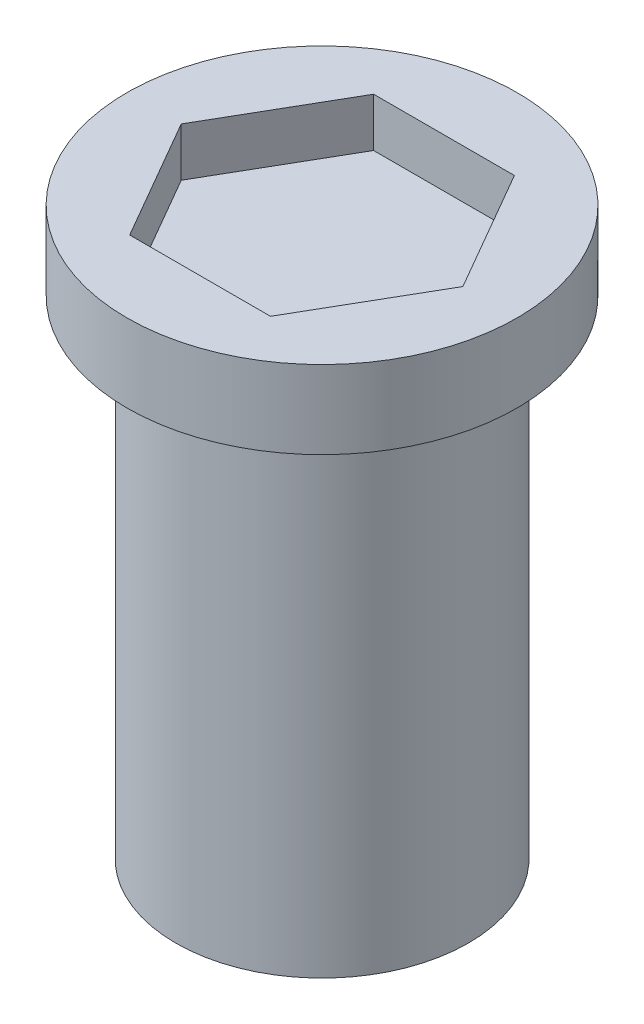
ISO-10303-21;
HEADER;
FILE_DESCRIPTION(('STEP AP214'),'2;1');
FILE_NAME('part.step','',(''),(''),'','','');
FILE_SCHEMA(('AUTOMOTIVE_DESIGN { 1 0 10303 214 1 1 1 1 }'));
ENDSEC;
DATA;
#1=APPLICATION_CONTEXT('core data for automotive mechanical design processes');
#2=APPLICATION_PROTOCOL_DEFINITION('international standard','automotive_design',2000,#1);
#3=PRODUCT_CONTEXT('',#1,'mechanical');
#4=PRODUCT('Part','Part','',(#3));
#5=PRODUCT_RELATED_PRODUCT_CATEGORY('part','',(#4));
#6=PRODUCT_DEFINITION_FORMATION('','',#4);
#7=PRODUCT_DEFINITION_CONTEXT('part definition',#1,'design');
#8=PRODUCT_DEFINITION('design','',#6,#7);
#9=PRODUCT_DEFINITION_SHAPE('','',#8);
#10=(LENGTH_UNIT() NAMED_UNIT(*) SI_UNIT(.MILLI.,.METRE.));
#11=(NAMED_UNIT(*) PLANE_ANGLE_UNIT() SI_UNIT($,.RADIAN.));
#12=(NAMED_UNIT(*) SI_UNIT($,.STERADIAN.) SOLID_ANGLE_UNIT());
#13=UNCERTAINTY_MEASURE_WITH_UNIT(LENGTH_MEASURE(1.E-05),#10,'distance_accuracy_value','');
#14=(GEOMETRIC_REPRESENTATION_CONTEXT(3) GLOBAL_UNCERTAINTY_ASSIGNED_CONTEXT((#13)) GLOBAL_UNIT_ASSIGNED_CONTEXT((#10,
#11,#12)) REPRESENTATION_CONTEXT('',''));
#15=CARTESIAN_POINT('',(0.,0.,0.));
#16=DIRECTION('',(0.,0.,1.));
#17=DIRECTION('',(1.,0.,0.));
#18=AXIS2_PLACEMENT_3D('',#15,#16,#17);
#19=CARTESIAN_POINT('',(0.,50.,0.));
#20=DIRECTION('',(0.,-1.,0.));
#21=DIRECTION('',(0.,0.,-1.));
#22=AXIS2_PLACEMENT_3D('',#19,#20,#21);
#23=CYLINDRICAL_SURFACE('',#22,15.);
#24=CARTESIAN_POINT('',(0.,50.,0.));
#25=DIRECTION('',(0.,1.,0.));
#26=DIRECTION('',(0.,0.,1.));
#27=AXIS2_PLACEMENT_3D('',#24,#25,#26);
#28=CIRCLE('',#27,15.);
#29=CARTESIAN_POINT('',(0.,50.,15.));
#30=VERTEX_POINT('',#29);
#31=EDGE_CURVE('E11',#30,#30,#28,.T.);
#32=ORIENTED_EDGE('',*,*,#31,.F.);
#33=EDGE_LOOP('',(#32));
#34=FACE_BOUND('',#33,.T.);
#35=CARTESIAN_POINT('',(0.,0.,0.));
#36=DIRECTION('',(0.,1.,0.));
#37=DIRECTION('',(0.,0.,1.));
#38=AXIS2_PLACEMENT_3D('',#35,#36,#37);
#39=CIRCLE('',#38,15.);
#40=CARTESIAN_POINT('',(0.,0.,15.));
#41=VERTEX_POINT('',#40);
#42=EDGE_CURVE('E46',#41,#41,#39,.T.);
#43=ORIENTED_EDGE('',*,*,#42,.T.);
#44=EDGE_LOOP('',(#43));
#45=FACE_BOUND('',#44,.T.);
#46=ADVANCED_FACE('F43',(#34,#45),#23,.T.);
#47=CARTESIAN_POINT('',(0.,0.,0.));
#48=DIRECTION('',(0.,1.,0.));
#49=DIRECTION('',(0.,0.,1.));
#50=AXIS2_PLACEMENT_3D('',#47,#48,#49);
#51=PLANE('',#50);
#52=ORIENTED_EDGE('',*,*,#42,.F.);
#53=EDGE_LOOP('',(#52));
#54=FACE_BOUND('',#53,.T.);
#55=ADVANCED_FACE('F193',(#54),#51,.F.);
#56=CARTESIAN_POINT('',(0.,58.,0.));
#57=DIRECTION('',(0.,-1.,0.));
#58=DIRECTION('',(0.,0.,-1.));
#59=AXIS2_PLACEMENT_3D('',#56,#57,#58);
#60=CYLINDRICAL_SURFACE('',#59,20.);
#61=CARTESIAN_POINT('',(0.,58.,0.));
#62=DIRECTION('',(0.,1.,0.));
#63=DIRECTION('',(0.,0.,1.));
#64=AXIS2_PLACEMENT_3D('',#61,#62,#63);
#65=CIRCLE('',#64,20.);
#66=CARTESIAN_POINT('',(0.,58.,20.));
#67=VERTEX_POINT('',#66);
#68=EDGE_CURVE('E167',#67,#67,#65,.T.);
#69=ORIENTED_EDGE('',*,*,#68,.F.);
#70=EDGE_LOOP('',(#69));
#71=FACE_BOUND('',#70,.T.);
#72=CARTESIAN_POINT('',(0.,50.,0.));
#73=DIRECTION('',(0.,1.,0.));
#74=DIRECTION('',(0.,0.,1.));
#75=AXIS2_PLACEMENT_3D('',#72,#73,#74);
#76=CIRCLE('',#75,20.);
#77=CARTESIAN_POINT('',(0.,50.,20.));
#78=VERTEX_POINT('',#77);
#79=EDGE_CURVE('E157',#78,#78,#76,.T.);
#80=ORIENTED_EDGE('',*,*,#79,.T.);
#81=EDGE_LOOP('',(#80));
#82=FACE_BOUND('',#81,.T.);
#83=ADVANCED_FACE('F175',(#71,#82),#60,.T.);
#84=CARTESIAN_POINT('',(0.,58.,0.));
#85=DIRECTION('',(0.,1.,0.));
#86=DIRECTION('',(0.,0.,1.));
#87=AXIS2_PLACEMENT_3D('',#84,#85,#86);
#88=PLANE('',#87);
#89=DIRECTION('',(-0.5,0.,0.866025403784439));
#90=VECTOR('',#89,1.);
#91=CARTESIAN_POINT('',(-7.21687836487032,58.,-12.5));
#92=LINE('',#91,#90);
#93=CARTESIAN_POINT('',(-7.21687836487032,58.,-12.5));
#94=VERTEX_POINT('',#93);
#95=CARTESIAN_POINT('',(-14.4337567297406,58.,0.));
#96=VERTEX_POINT('',#95);
#97=EDGE_CURVE('E58',#94,#96,#92,.T.);
#98=ORIENTED_EDGE('',*,*,#97,.F.);
#99=DIRECTION('',(-1.,0.,0.));
#100=VECTOR('',#99,1.);
#101=CARTESIAN_POINT('',(7.21687836487031,58.,-12.5));
#102=LINE('',#101,#100);
#103=CARTESIAN_POINT('',(7.21687836487031,58.,-12.5));
#104=VERTEX_POINT('',#103);
#105=EDGE_CURVE('E151',#104,#94,#102,.T.);
#106=ORIENTED_EDGE('',*,*,#105,.F.);
#107=DIRECTION('',(-0.5,0.,-0.866025403784439));
#108=VECTOR('',#107,1.);
#109=CARTESIAN_POINT('',(14.4337567297406,58.,0.));
#110=LINE('',#109,#108);
#111=CARTESIAN_POINT('',(14.4337567297406,58.,0.));
#112=VERTEX_POINT('',#111);
#113=EDGE_CURVE('E148',#112,#104,#110,.T.);
#114=ORIENTED_EDGE('',*,*,#113,.F.);
#115=DIRECTION('',(0.5,0.,-0.866025403784439));
#116=VECTOR('',#115,1.);
#117=CARTESIAN_POINT('',(7.21687836487032,58.,12.5));
#118=LINE('',#117,#116);
#119=CARTESIAN_POINT('',(7.21687836487032,58.,12.5));
#120=VERTEX_POINT('',#119);
#121=EDGE_CURVE('E106',#120,#112,#118,.T.);
#122=ORIENTED_EDGE('',*,*,#121,.F.);
#123=DIRECTION('',(1.,0.,0.));
#124=VECTOR('',#123,1.);
#125=CARTESIAN_POINT('',(-7.21687836487032,58.,12.5));
#126=LINE('',#125,#124);
#127=CARTESIAN_POINT('',(-7.21687836487032,58.,12.5));
#128=VERTEX_POINT('',#127);
#129=EDGE_CURVE('E142',#128,#120,#126,.T.);
#130=ORIENTED_EDGE('',*,*,#129,.F.);
#131=DIRECTION('',(0.5,0.,0.866025403784439));
#132=VECTOR('',#131,1.);
#133=CARTESIAN_POINT('',(-14.4337567297406,58.,0.));
#134=LINE('',#133,#132);
#135=EDGE_CURVE('E138',#96,#128,#134,.T.);
#136=ORIENTED_EDGE('',*,*,#135,.F.);
#137=EDGE_LOOP('',(#98,#106,#114,#122,#130,#136));
#138=FACE_BOUND('',#137,.T.);
#139=ORIENTED_EDGE('',*,*,#68,.T.);
#140=EDGE_LOOP('',(#139));
#141=FACE_BOUND('',#140,.T.);
#142=ADVANCED_FACE('F180',(#138,#141),#88,.T.);
#143=CARTESIAN_POINT('',(0.,50.,0.));
#144=DIRECTION('',(0.,1.,0.));
#145=DIRECTION('',(0.,0.,1.));
#146=AXIS2_PLACEMENT_3D('',#143,#144,#145);
#147=PLANE('',#146);
#148=ORIENTED_EDGE('',*,*,#31,.T.);
#149=EDGE_LOOP('',(#148));
#150=FACE_BOUND('',#149,.T.);
#151=ORIENTED_EDGE('',*,*,#79,.F.);
#152=EDGE_LOOP('',(#151));
#153=FACE_BOUND('',#152,.T.);
#154=ADVANCED_FACE('F177',(#150,#153),#147,.F.);
#155=CARTESIAN_POINT('',(-7.21687836487032,53.,-12.5));
#156=DIRECTION('',(-0.866025403784439,0.,-0.5));
#157=DIRECTION('',(-0.5,0.,0.866025403784439));
#158=AXIS2_PLACEMENT_3D('',#155,#156,#157);
#159=PLANE('',#158);
#160=ORIENTED_EDGE('',*,*,#97,.T.);
#161=DIRECTION('',(0.,1.,0.));
#162=VECTOR('',#161,1.);
#163=CARTESIAN_POINT('',(-14.4337567297406,53.,0.));
#164=LINE('',#163,#162);
#165=CARTESIAN_POINT('',(-14.4337567297406,53.,0.));
#166=VERTEX_POINT('',#165);
#167=EDGE_CURVE('E88',#166,#96,#164,.T.);
#168=ORIENTED_EDGE('',*,*,#167,.F.);
#169=DIRECTION('',(-0.5,0.,0.866025403784439));
#170=VECTOR('',#169,1.);
#171=CARTESIAN_POINT('',(-7.21687836487032,53.,-12.5));
#172=LINE('',#171,#170);
#173=CARTESIAN_POINT('',(-7.21687836487032,53.,-12.5));
#174=VERTEX_POINT('',#173);
#175=EDGE_CURVE('E154',#174,#166,#172,.T.);
#176=ORIENTED_EDGE('',*,*,#175,.F.);
#177=DIRECTION('',(0.,1.,0.));
#178=VECTOR('',#177,1.);
#179=CARTESIAN_POINT('',(-7.21687836487032,53.,-12.5));
#180=LINE('',#179,#178);
#181=EDGE_CURVE('E66',#174,#94,#180,.T.);
#182=ORIENTED_EDGE('',*,*,#181,.T.);
#183=EDGE_LOOP('',(#160,#168,#176,#182));
#184=FACE_BOUND('',#183,.T.);
#185=ADVANCED_FACE('F179',(#184),#159,.F.);
#186=CARTESIAN_POINT('',(7.21687836487031,53.,-12.5));
#187=DIRECTION('',(0.,0.,-1.));
#188=DIRECTION('',(-1.,0.,0.));
#189=AXIS2_PLACEMENT_3D('',#186,#187,#188);
#190=PLANE('',#189);
#191=ORIENTED_EDGE('',*,*,#105,.T.);
#192=ORIENTED_EDGE('',*,*,#181,.F.);
#193=DIRECTION('',(-1.,0.,0.));
#194=VECTOR('',#193,1.);
#195=CARTESIAN_POINT('',(7.21687836487031,53.,-12.5));
#196=LINE('',#195,#194);
#197=CARTESIAN_POINT('',(7.21687836487031,53.,-12.5));
#198=VERTEX_POINT('',#197);
#199=EDGE_CURVE('E120',#198,#174,#196,.T.);
#200=ORIENTED_EDGE('',*,*,#199,.F.);
#201=DIRECTION('',(0.,1.,0.));
#202=VECTOR('',#201,1.);
#203=CARTESIAN_POINT('',(7.21687836487031,53.,-12.5));
#204=LINE('',#203,#202);
#205=EDGE_CURVE('E111',#198,#104,#204,.T.);
#206=ORIENTED_EDGE('',*,*,#205,.T.);
#207=EDGE_LOOP('',(#191,#192,#200,#206));
#208=FACE_BOUND('',#207,.T.);
#209=ADVANCED_FACE('F187',(#208),#190,.F.);
#210=CARTESIAN_POINT('',(14.4337567297406,53.,0.));
#211=DIRECTION('',(0.866025403784439,0.,-0.5));
#212=DIRECTION('',(-0.5,0.,-0.866025403784439));
#213=AXIS2_PLACEMENT_3D('',#210,#211,#212);
#214=PLANE('',#213);
#215=ORIENTED_EDGE('',*,*,#113,.T.);
#216=ORIENTED_EDGE('',*,*,#205,.F.);
#217=DIRECTION('',(-0.5,0.,-0.866025403784439));
#218=VECTOR('',#217,1.);
#219=CARTESIAN_POINT('',(14.4337567297406,53.,0.));
#220=LINE('',#219,#218);
#221=CARTESIAN_POINT('',(14.4337567297406,53.,0.));
#222=VERTEX_POINT('',#221);
#223=EDGE_CURVE('E115',#222,#198,#220,.T.);
#224=ORIENTED_EDGE('',*,*,#223,.F.);
#225=DIRECTION('',(0.,1.,0.));
#226=VECTOR('',#225,1.);
#227=CARTESIAN_POINT('',(14.4337567297406,53.,0.));
#228=LINE('',#227,#226);
#229=EDGE_CURVE('E99',#222,#112,#228,.T.);
#230=ORIENTED_EDGE('',*,*,#229,.T.);
#231=EDGE_LOOP('',(#215,#216,#224,#230));
#232=FACE_BOUND('',#231,.T.);
#233=ADVANCED_FACE('F116',(#232),#214,.F.);
#234=CARTESIAN_POINT('',(7.21687836487032,53.,12.5));
#235=DIRECTION('',(0.866025403784439,0.,0.5));
#236=DIRECTION('',(0.5,0.,-0.866025403784439));
#237=AXIS2_PLACEMENT_3D('',#234,#235,#236);
#238=PLANE('',#237);
#239=ORIENTED_EDGE('',*,*,#121,.T.);
#240=ORIENTED_EDGE('',*,*,#229,.F.);
#241=DIRECTION('',(0.5,0.,-0.866025403784439));
#242=VECTOR('',#241,1.);
#243=CARTESIAN_POINT('',(7.21687836487032,53.,12.5));
#244=LINE('',#243,#242);
#245=CARTESIAN_POINT('',(7.21687836487032,53.,12.5));
#246=VERTEX_POINT('',#245);
#247=EDGE_CURVE('E103',#246,#222,#244,.T.);
#248=ORIENTED_EDGE('',*,*,#247,.F.);
#249=DIRECTION('',(0.,1.,0.));
#250=VECTOR('',#249,1.);
#251=CARTESIAN_POINT('',(7.21687836487032,53.,12.5));
#252=LINE('',#251,#250);
#253=EDGE_CURVE('E112',#246,#120,#252,.T.);
#254=ORIENTED_EDGE('',*,*,#253,.T.);
#255=EDGE_LOOP('',(#239,#240,#248,#254));
#256=FACE_BOUND('',#255,.T.);
#257=ADVANCED_FACE('F101',(#256),#238,.F.);
#258=CARTESIAN_POINT('',(-7.21687836487032,53.,12.5));
#259=DIRECTION('',(0.,0.,1.));
#260=DIRECTION('',(1.,0.,0.));
#261=AXIS2_PLACEMENT_3D('',#258,#259,#260);
#262=PLANE('',#261);
#263=ORIENTED_EDGE('',*,*,#129,.T.);
#264=ORIENTED_EDGE('',*,*,#253,.F.);
#265=DIRECTION('',(1.,0.,0.));
#266=VECTOR('',#265,1.);
#267=CARTESIAN_POINT('',(-7.21687836487032,53.,12.5));
#268=LINE('',#267,#266);
#269=CARTESIAN_POINT('',(-7.21687836487032,53.,12.5));
#270=VERTEX_POINT('',#269);
#271=EDGE_CURVE('E126',#270,#246,#268,.T.);
#272=ORIENTED_EDGE('',*,*,#271,.F.);
#273=DIRECTION('',(0.,1.,0.));
#274=VECTOR('',#273,1.);
#275=CARTESIAN_POINT('',(-7.21687836487032,53.,12.5));
#276=LINE('',#275,#274);
#277=EDGE_CURVE('E162',#270,#128,#276,.T.);
#278=ORIENTED_EDGE('',*,*,#277,.T.);
#279=EDGE_LOOP('',(#263,#264,#272,#278));
#280=FACE_BOUND('',#279,.T.);
#281=ADVANCED_FACE('F253',(#280),#262,.F.);
#282=CARTESIAN_POINT('',(-14.4337567297406,53.,0.));
#283=DIRECTION('',(-0.866025403784439,0.,0.5));
#284=DIRECTION('',(0.5,0.,0.866025403784439));
#285=AXIS2_PLACEMENT_3D('',#282,#283,#284);
#286=PLANE('',#285);
#287=ORIENTED_EDGE('',*,*,#135,.T.);
#288=ORIENTED_EDGE('',*,*,#277,.F.);
#289=DIRECTION('',(0.5,0.,0.866025403784439));
#290=VECTOR('',#289,1.);
#291=CARTESIAN_POINT('',(-14.4337567297406,53.,0.));
#292=LINE('',#291,#290);
#293=EDGE_CURVE('E130',#166,#270,#292,.T.);
#294=ORIENTED_EDGE('',*,*,#293,.F.);
#295=ORIENTED_EDGE('',*,*,#167,.T.);
#296=EDGE_LOOP('',(#287,#288,#294,#295));
#297=FACE_BOUND('',#296,.T.);
#298=ADVANCED_FACE('F263',(#297),#286,.F.);
#299=CARTESIAN_POINT('',(0.,53.,0.));
#300=DIRECTION('',(0.,1.,0.));
#301=DIRECTION('',(0.,0.,1.));
#302=AXIS2_PLACEMENT_3D('',#299,#300,#301);
#303=PLANE('',#302);
#304=ORIENTED_EDGE('',*,*,#175,.T.);
#305=ORIENTED_EDGE('',*,*,#293,.T.);
#306=ORIENTED_EDGE('',*,*,#271,.T.);
#307=ORIENTED_EDGE('',*,*,#247,.T.);
#308=ORIENTED_EDGE('',*,*,#223,.T.);
#309=ORIENTED_EDGE('',*,*,#199,.T.);
#310=EDGE_LOOP('',(#304,#305,#306,#307,#308,#309));
#311=FACE_BOUND('',#310,.T.);
#312=ADVANCED_FACE('F123',(#311),#303,.T.);
#313=CLOSED_SHELL('',(#46,#55,#83,#142,#154,#185,#209,#233,#257,#281,#298,#312));
#314=MANIFOLD_SOLID_BREP('B2',#313);
#315=ADVANCED_BREP_SHAPE_REPRESENTATION('',(#18,#314),#14);
#316=SHAPE_DEFINITION_REPRESENTATION(#9,#315);
ENDSEC;
END-ISO-10303-21;
